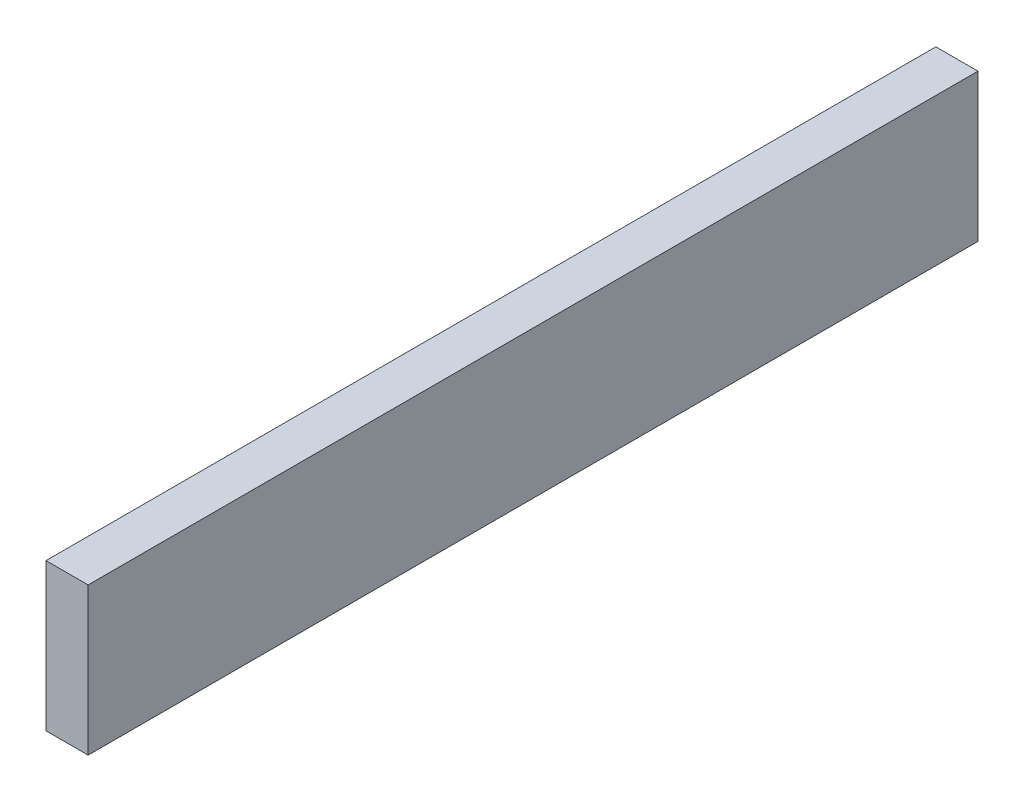
ISO-10303-21;
HEADER;
FILE_DESCRIPTION(('STEP AP214'),'2;1');
FILE_NAME('part.step','',(''),(''),'','','');
FILE_SCHEMA(('AUTOMOTIVE_DESIGN { 1 0 10303 214 1 1 1 1 }'));
ENDSEC;
DATA;
#1=APPLICATION_CONTEXT('core data for automotive mechanical design processes');
#2=APPLICATION_PROTOCOL_DEFINITION('international standard','automotive_design',2000,#1);
#3=PRODUCT_CONTEXT('',#1,'mechanical');
#4=PRODUCT('Part','Part','',(#3));
#5=PRODUCT_RELATED_PRODUCT_CATEGORY('part','',(#4));
#6=PRODUCT_DEFINITION_FORMATION('','',#4);
#7=PRODUCT_DEFINITION_CONTEXT('part definition',#1,'design');
#8=PRODUCT_DEFINITION('design','',#6,#7);
#9=PRODUCT_DEFINITION_SHAPE('','',#8);
#10=(LENGTH_UNIT() NAMED_UNIT(*) SI_UNIT(.MILLI.,.METRE.));
#11=(NAMED_UNIT(*) PLANE_ANGLE_UNIT() SI_UNIT($,.RADIAN.));
#12=(NAMED_UNIT(*) SI_UNIT($,.STERADIAN.) SOLID_ANGLE_UNIT());
#13=UNCERTAINTY_MEASURE_WITH_UNIT(LENGTH_MEASURE(1.E-05),#10,'distance_accuracy_value','');
#14=(GEOMETRIC_REPRESENTATION_CONTEXT(3) GLOBAL_UNCERTAINTY_ASSIGNED_CONTEXT((#13)) GLOBAL_UNIT_ASSIGNED_CONTEXT((#10,
#11,#12)) REPRESENTATION_CONTEXT('',''));
#15=CARTESIAN_POINT('',(0.,0.,0.));
#16=DIRECTION('',(0.,0.,1.));
#17=DIRECTION('',(1.,0.,0.));
#18=AXIS2_PLACEMENT_3D('',#15,#16,#17);
#19=CARTESIAN_POINT('',(-4.,7.,-42.25));
#20=DIRECTION('',(0.,0.,-1.));
#21=DIRECTION('',(0.,1.,0.));
#22=AXIS2_PLACEMENT_3D('',#19,#20,#21);
#23=PLANE('',#22);
#24=DIRECTION('',(0.,1.,0.));
#25=VECTOR('',#24,1.);
#26=CARTESIAN_POINT('',(0.,7.,-42.25));
#27=LINE('',#26,#25);
#28=CARTESIAN_POINT('',(0.,-7.,-42.25));
#29=VERTEX_POINT('',#28);
#30=CARTESIAN_POINT('',(0.,7.,-42.25));
#31=VERTEX_POINT('',#30);
#32=EDGE_CURVE('E101',#29,#31,#27,.T.);
#33=ORIENTED_EDGE('',*,*,#32,.F.);
#34=DIRECTION('',(1.,0.,0.));
#35=VECTOR('',#34,1.);
#36=CARTESIAN_POINT('',(-4.,-7.,-42.25));
#37=LINE('',#36,#35);
#38=CARTESIAN_POINT('',(-4.,-7.,-42.25));
#39=VERTEX_POINT('',#38);
#40=EDGE_CURVE('E11',#39,#29,#37,.T.);
#41=ORIENTED_EDGE('',*,*,#40,.F.);
#42=DIRECTION('',(0.,1.,0.));
#43=VECTOR('',#42,1.);
#44=CARTESIAN_POINT('',(-4.,7.,-42.25));
#45=LINE('',#44,#43);
#46=CARTESIAN_POINT('',(-4.,7.,-42.25));
#47=VERTEX_POINT('',#46);
#48=EDGE_CURVE('E95',#39,#47,#45,.T.);
#49=ORIENTED_EDGE('',*,*,#48,.T.);
#50=DIRECTION('',(1.,0.,0.));
#51=VECTOR('',#50,1.);
#52=CARTESIAN_POINT('',(-4.,7.,-42.25));
#53=LINE('',#52,#51);
#54=EDGE_CURVE('E40',#47,#31,#53,.T.);
#55=ORIENTED_EDGE('',*,*,#54,.T.);
#56=EDGE_LOOP('',(#33,#41,#49,#55));
#57=FACE_BOUND('',#56,.T.);
#58=ADVANCED_FACE('F37',(#57),#23,.T.);
#59=CARTESIAN_POINT('',(-4.,-7.,42.25));
#60=DIRECTION('',(0.,-1.,0.));
#61=DIRECTION('',(0.,0.,-1.));
#62=AXIS2_PLACEMENT_3D('',#59,#60,#61);
#63=PLANE('',#62);
#64=DIRECTION('',(0.,0.,-1.));
#65=VECTOR('',#64,1.);
#66=CARTESIAN_POINT('',(0.,-7.,42.25));
#67=LINE('',#66,#65);
#68=CARTESIAN_POINT('',(0.,-7.,42.25));
#69=VERTEX_POINT('',#68);
#70=EDGE_CURVE('E97',#69,#29,#67,.T.);
#71=ORIENTED_EDGE('',*,*,#70,.F.);
#72=DIRECTION('',(1.,0.,0.));
#73=VECTOR('',#72,1.);
#74=CARTESIAN_POINT('',(-4.,-7.,42.25));
#75=LINE('',#74,#73);
#76=CARTESIAN_POINT('',(-4.,-7.,42.25));
#77=VERTEX_POINT('',#76);
#78=EDGE_CURVE('E46',#77,#69,#75,.T.);
#79=ORIENTED_EDGE('',*,*,#78,.F.);
#80=DIRECTION('',(0.,0.,-1.));
#81=VECTOR('',#80,1.);
#82=CARTESIAN_POINT('',(-4.,-7.,42.25));
#83=LINE('',#82,#81);
#84=EDGE_CURVE('E92',#77,#39,#83,.T.);
#85=ORIENTED_EDGE('',*,*,#84,.T.);
#86=ORIENTED_EDGE('',*,*,#40,.T.);
#87=EDGE_LOOP('',(#71,#79,#85,#86));
#88=FACE_BOUND('',#87,.T.);
#89=ADVANCED_FACE('F111',(#88),#63,.T.);
#90=CARTESIAN_POINT('',(-4.,7.,42.25));
#91=DIRECTION('',(0.,0.,1.));
#92=DIRECTION('',(0.,-1.,0.));
#93=AXIS2_PLACEMENT_3D('',#90,#91,#92);
#94=PLANE('',#93);
#95=DIRECTION('',(0.,-1.,0.));
#96=VECTOR('',#95,1.);
#97=CARTESIAN_POINT('',(0.,7.,42.25));
#98=LINE('',#97,#96);
#99=CARTESIAN_POINT('',(0.,7.,42.25));
#100=VERTEX_POINT('',#99);
#101=EDGE_CURVE('E87',#100,#69,#98,.T.);
#102=ORIENTED_EDGE('',*,*,#101,.F.);
#103=DIRECTION('',(1.,0.,0.));
#104=VECTOR('',#103,1.);
#105=CARTESIAN_POINT('',(-4.,7.,42.25));
#106=LINE('',#105,#104);
#107=CARTESIAN_POINT('',(-4.,7.,42.25));
#108=VERTEX_POINT('',#107);
#109=EDGE_CURVE('E82',#108,#100,#106,.T.);
#110=ORIENTED_EDGE('',*,*,#109,.F.);
#111=DIRECTION('',(0.,-1.,0.));
#112=VECTOR('',#111,1.);
#113=CARTESIAN_POINT('',(-4.,7.,42.25));
#114=LINE('',#113,#112);
#115=EDGE_CURVE('E85',#108,#77,#114,.T.);
#116=ORIENTED_EDGE('',*,*,#115,.T.);
#117=ORIENTED_EDGE('',*,*,#78,.T.);
#118=EDGE_LOOP('',(#102,#110,#116,#117));
#119=FACE_BOUND('',#118,.T.);
#120=ADVANCED_FACE('F84',(#119),#94,.T.);
#121=CARTESIAN_POINT('',(-4.,7.,42.25));
#122=DIRECTION('',(0.,1.,0.));
#123=DIRECTION('',(0.,0.,1.));
#124=AXIS2_PLACEMENT_3D('',#121,#122,#123);
#125=PLANE('',#124);
#126=DIRECTION('',(0.,0.,1.));
#127=VECTOR('',#126,1.);
#128=CARTESIAN_POINT('',(0.,7.,42.25));
#129=LINE('',#128,#127);
#130=EDGE_CURVE('E104',#31,#100,#129,.T.);
#131=ORIENTED_EDGE('',*,*,#130,.F.);
#132=ORIENTED_EDGE('',*,*,#54,.F.);
#133=DIRECTION('',(0.,0.,1.));
#134=VECTOR('',#133,1.);
#135=CARTESIAN_POINT('',(-4.,7.,42.25));
#136=LINE('',#135,#134);
#137=EDGE_CURVE('E91',#47,#108,#136,.T.);
#138=ORIENTED_EDGE('',*,*,#137,.T.);
#139=ORIENTED_EDGE('',*,*,#109,.T.);
#140=EDGE_LOOP('',(#131,#132,#138,#139));
#141=FACE_BOUND('',#140,.T.);
#142=ADVANCED_FACE('F94',(#141),#125,.T.);
#143=CARTESIAN_POINT('',(-4.,0.,0.));
#144=DIRECTION('',(1.,0.,0.));
#145=DIRECTION('',(0.,0.,-1.));
#146=AXIS2_PLACEMENT_3D('',#143,#144,#145);
#147=PLANE('',#146);
#148=ORIENTED_EDGE('',*,*,#48,.F.);
#149=ORIENTED_EDGE('',*,*,#84,.F.);
#150=ORIENTED_EDGE('',*,*,#115,.F.);
#151=ORIENTED_EDGE('',*,*,#137,.F.);
#152=EDGE_LOOP('',(#148,#149,#150,#151));
#153=FACE_BOUND('',#152,.T.);
#154=ADVANCED_FACE('F90',(#153),#147,.F.);
#155=CARTESIAN_POINT('',(0.,0.,0.));
#156=DIRECTION('',(1.,0.,0.));
#157=DIRECTION('',(0.,0.,-1.));
#158=AXIS2_PLACEMENT_3D('',#155,#156,#157);
#159=PLANE('',#158);
#160=ORIENTED_EDGE('',*,*,#32,.T.);
#161=ORIENTED_EDGE('',*,*,#130,.T.);
#162=ORIENTED_EDGE('',*,*,#101,.T.);
#163=ORIENTED_EDGE('',*,*,#70,.T.);
#164=EDGE_LOOP('',(#160,#161,#162,#163));
#165=FACE_BOUND('',#164,.T.);
#166=ADVANCED_FACE('F110',(#165),#159,.T.);
#167=CLOSED_SHELL('',(#58,#89,#120,#142,#154,#166));
#168=MANIFOLD_SOLID_BREP('B2',#167);
#169=ADVANCED_BREP_SHAPE_REPRESENTATION('',(#18,#168),#14);
#170=SHAPE_DEFINITION_REPRESENTATION(#9,#169);
ENDSEC;
END-ISO-10303-21;
